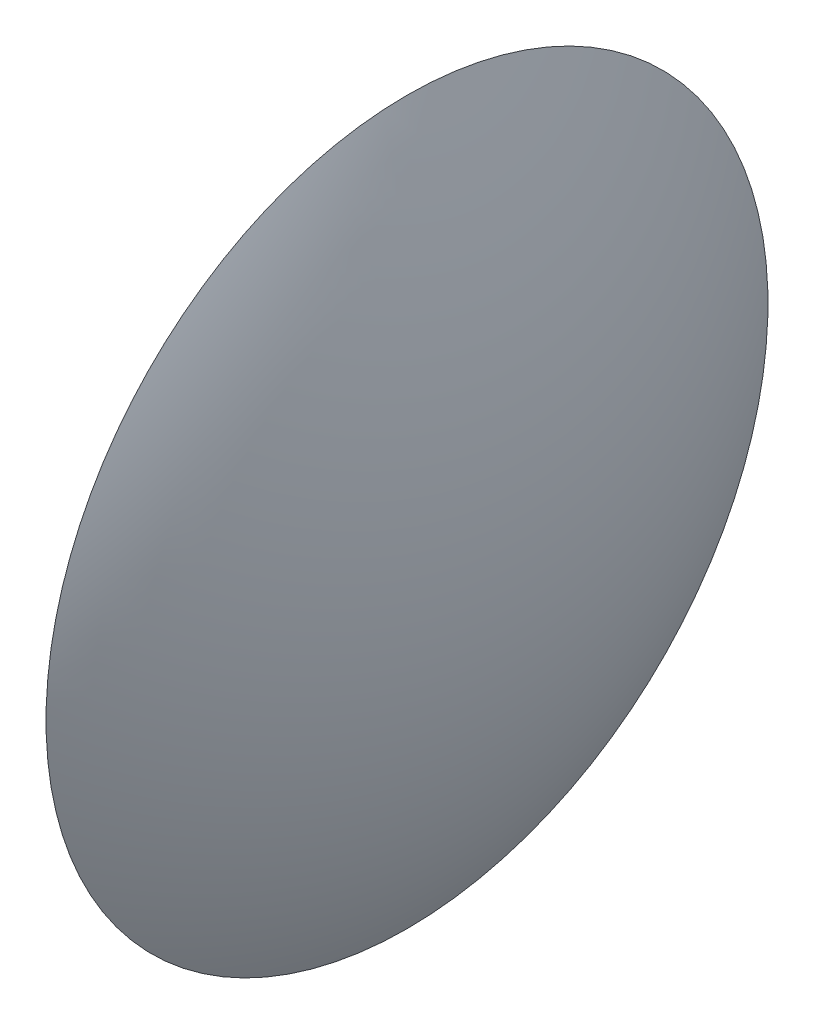
ISO-10303-21;
HEADER;
FILE_DESCRIPTION(('STEP AP214'),'2;1');
FILE_NAME('part.step','',(''),(''),'','','');
FILE_SCHEMA(('AUTOMOTIVE_DESIGN { 1 0 10303 214 1 1 1 1 }'));
ENDSEC;
DATA;
#1=APPLICATION_CONTEXT('core data for automotive mechanical design processes');
#2=APPLICATION_PROTOCOL_DEFINITION('international standard','automotive_design',2000,#1);
#3=PRODUCT_CONTEXT('',#1,'mechanical');
#4=PRODUCT('Part','Part','',(#3));
#5=PRODUCT_RELATED_PRODUCT_CATEGORY('part','',(#4));
#6=PRODUCT_DEFINITION_FORMATION('','',#4);
#7=PRODUCT_DEFINITION_CONTEXT('part definition',#1,'design');
#8=PRODUCT_DEFINITION('design','',#6,#7);
#9=PRODUCT_DEFINITION_SHAPE('','',#8);
#10=(LENGTH_UNIT() NAMED_UNIT(*) SI_UNIT(.MILLI.,.METRE.));
#11=(NAMED_UNIT(*) PLANE_ANGLE_UNIT() SI_UNIT($,.RADIAN.));
#12=(NAMED_UNIT(*) SI_UNIT($,.STERADIAN.) SOLID_ANGLE_UNIT());
#13=UNCERTAINTY_MEASURE_WITH_UNIT(LENGTH_MEASURE(1.E-05),#10,'distance_accuracy_value','');
#14=(GEOMETRIC_REPRESENTATION_CONTEXT(3) GLOBAL_UNCERTAINTY_ASSIGNED_CONTEXT((#13)) GLOBAL_UNIT_ASSIGNED_CONTEXT((#10,
#11,#12)) REPRESENTATION_CONTEXT('',''));
#15=CARTESIAN_POINT('',(0.,0.,0.));
#16=DIRECTION('',(0.,0.,1.));
#17=DIRECTION('',(1.,0.,0.));
#18=AXIS2_PLACEMENT_3D('',#15,#16,#17);
#19=CARTESIAN_POINT('',(-7.605,0.,0.));
#20=DIRECTION('',(-1.,0.,0.));
#21=DIRECTION('',(0.,1.,0.));
#22=AXIS2_PLACEMENT_3D('',#19,#20,#21);
#23=SPHERICAL_SURFACE('',#22,8.105);
#24=CARTESIAN_POINT('',(-0.5,0.,0.));
#25=DIRECTION('',(-1.,0.,0.));
#26=DIRECTION('',(0.,-1.,0.));
#27=AXIS2_PLACEMENT_3D('',#24,#25,#26);
#28=CIRCLE('',#27,3.9);
#29=CARTESIAN_POINT('',(-0.5,-3.9,0.));
#30=VERTEX_POINT('',#29);
#31=EDGE_CURVE('E10',#30,#30,#28,.T.);
#32=ORIENTED_EDGE('',*,*,#31,.F.);
#33=EDGE_LOOP('',(#32));
#34=FACE_BOUND('',#33,.T.);
#35=ADVANCED_FACE('F30',(#34),#23,.T.);
#36=CARTESIAN_POINT('',(-0.5,0.,0.));
#37=DIRECTION('',(1.,0.,0.));
#38=DIRECTION('',(0.,1.,0.));
#39=AXIS2_PLACEMENT_3D('',#36,#37,#38);
#40=PLANE('',#39);
#41=ORIENTED_EDGE('',*,*,#31,.T.);
#42=EDGE_LOOP('',(#41));
#43=FACE_BOUND('',#42,.T.);
#44=ADVANCED_FACE('F37',(#43),#40,.F.);
#45=CLOSED_SHELL('',(#35,#44));
#46=MANIFOLD_SOLID_BREP('B2',#45);
#47=ADVANCED_BREP_SHAPE_REPRESENTATION('',(#18,#46),#14);
#48=SHAPE_DEFINITION_REPRESENTATION(#9,#47);
ENDSEC;
END-ISO-10303-21;
